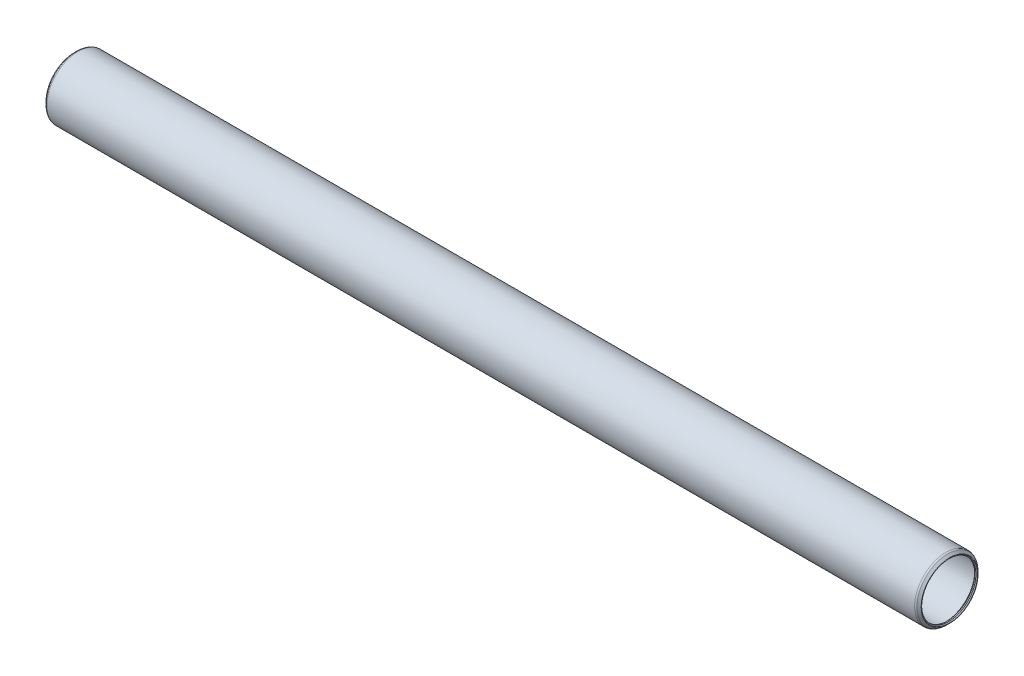
ISO-10303-21;
HEADER;
FILE_DESCRIPTION(('STEP AP214'),'2;1');
FILE_NAME('part.step','',(''),(''),'','','');
FILE_SCHEMA(('AUTOMOTIVE_DESIGN { 1 0 10303 214 1 1 1 1 }'));
ENDSEC;
DATA;
#1=APPLICATION_CONTEXT('core data for automotive mechanical design processes');
#2=APPLICATION_PROTOCOL_DEFINITION('international standard','automotive_design',2000,#1);
#3=PRODUCT_CONTEXT('',#1,'mechanical');
#4=PRODUCT('Part','Part','',(#3));
#5=PRODUCT_RELATED_PRODUCT_CATEGORY('part','',(#4));
#6=PRODUCT_DEFINITION_FORMATION('','',#4);
#7=PRODUCT_DEFINITION_CONTEXT('part definition',#1,'design');
#8=PRODUCT_DEFINITION('design','',#6,#7);
#9=PRODUCT_DEFINITION_SHAPE('','',#8);
#10=(LENGTH_UNIT() NAMED_UNIT(*) SI_UNIT(.MILLI.,.METRE.));
#11=(NAMED_UNIT(*) PLANE_ANGLE_UNIT() SI_UNIT($,.RADIAN.));
#12=(NAMED_UNIT(*) SI_UNIT($,.STERADIAN.) SOLID_ANGLE_UNIT());
#13=UNCERTAINTY_MEASURE_WITH_UNIT(LENGTH_MEASURE(1.E-05),#10,'distance_accuracy_value','');
#14=(GEOMETRIC_REPRESENTATION_CONTEXT(3) GLOBAL_UNCERTAINTY_ASSIGNED_CONTEXT((#13)) GLOBAL_UNIT_ASSIGNED_CONTEXT((#10,
#11,#12)) REPRESENTATION_CONTEXT('',''));
#15=CARTESIAN_POINT('',(0.,0.,0.));
#16=DIRECTION('',(0.,0.,1.));
#17=DIRECTION('',(1.,0.,0.));
#18=AXIS2_PLACEMENT_3D('',#15,#16,#17);
#19=CARTESIAN_POINT('',(-0.549710244842875,0.,0.));
#20=DIRECTION('',(-1.,0.,0.));
#21=DIRECTION('',(0.,0.,1.));
#22=AXIS2_PLACEMENT_3D('',#19,#20,#21);
#23=TOROIDAL_SURFACE('',#22,9.25736536726415,0.126999999999895);
#24=CARTESIAN_POINT('',(-0.639512806053455,0.,0.));
#25=DIRECTION('',(-1.,0.,0.));
#26=DIRECTION('',(0.,0.,1.));
#27=AXIS2_PLACEMENT_3D('',#24,#25,#26);
#28=CIRCLE('',#27,9.1675628060535);
#29=CARTESIAN_POINT('',(-0.639512806053455,0.,9.1675628060535));
#30=VERTEX_POINT('',#29);
#31=EDGE_CURVE('E10',#30,#30,#28,.T.);
#32=ORIENTED_EDGE('',*,*,#31,.F.);
#33=EDGE_LOOP('',(#32));
#34=FACE_BOUND('',#33,.T.);
#35=CARTESIAN_POINT('',(-0.639512806053455,0.,0.));
#36=DIRECTION('',(-1.,0.,0.));
#37=DIRECTION('',(0.,0.,1.));
#38=AXIS2_PLACEMENT_3D('',#35,#36,#37);
#39=CIRCLE('',#38,9.3471679284748);
#40=CARTESIAN_POINT('',(-0.639512806053455,0.,9.3471679284748));
#41=VERTEX_POINT('',#40);
#42=EDGE_CURVE('E76',#41,#41,#39,.T.);
#43=ORIENTED_EDGE('',*,*,#42,.T.);
#44=EDGE_LOOP('',(#43));
#45=FACE_BOUND('',#44,.T.);
#46=ADVANCED_FACE('F30',(#34,#45),#23,.T.);
#47=CARTESIAN_POINT('',(-0.639512806053455,0.,0.));
#48=DIRECTION('',(-1.,0.,0.));
#49=DIRECTION('',(0.,0.,1.));
#50=AXIS2_PLACEMENT_3D('',#47,#48,#49);
#51=CONICAL_SURFACE('',#50,9.1675628060535,0.785398163397576);
#52=CARTESIAN_POINT('',(-0.38100000000002,0.,0.));
#53=DIRECTION('',(-1.,0.,0.));
#54=DIRECTION('',(0.,0.,1.));
#55=AXIS2_PLACEMENT_3D('',#52,#53,#54);
#56=CIRCLE('',#55,8.90905);
#57=CARTESIAN_POINT('',(-0.38100000000002,0.,8.90905));
#58=VERTEX_POINT('',#57);
#59=EDGE_CURVE('E36',#58,#58,#56,.T.);
#60=ORIENTED_EDGE('',*,*,#59,.F.);
#61=EDGE_LOOP('',(#60));
#62=FACE_BOUND('',#61,.T.);
#63=ORIENTED_EDGE('',*,*,#31,.T.);
#64=EDGE_LOOP('',(#63));
#65=FACE_BOUND('',#64,.T.);
#66=ADVANCED_FACE('F149',(#62,#65),#51,.F.);
#67=CARTESIAN_POINT('',(285.8897,0.,0.));
#68=DIRECTION('',(-1.,0.,0.));
#69=DIRECTION('',(0.,0.,1.));
#70=AXIS2_PLACEMENT_3D('',#67,#68,#69);
#71=CYLINDRICAL_SURFACE('',#70,8.90905);
#72=CARTESIAN_POINT('',(0.,0.,0.));
#73=DIRECTION('',(-1.,0.,0.));
#74=DIRECTION('',(0.,0.,1.));
#75=AXIS2_PLACEMENT_3D('',#72,#73,#74);
#76=CIRCLE('',#75,8.90905);
#77=CARTESIAN_POINT('',(0.,0.,8.90905));
#78=VERTEX_POINT('',#77);
#79=EDGE_CURVE('E40',#78,#78,#76,.T.);
#80=ORIENTED_EDGE('',*,*,#79,.F.);
#81=EDGE_LOOP('',(#80));
#82=FACE_BOUND('',#81,.T.);
#83=ORIENTED_EDGE('',*,*,#59,.T.);
#84=EDGE_LOOP('',(#83));
#85=FACE_BOUND('',#84,.T.);
#86=ADVANCED_FACE('F144',(#82,#85),#71,.F.);
#87=CARTESIAN_POINT('',(0.,0.,0.));
#88=DIRECTION('',(1.,0.,0.));
#89=DIRECTION('',(0.,0.,-1.));
#90=AXIS2_PLACEMENT_3D('',#87,#88,#89);
#91=CONICAL_SURFACE('',#90,8.90905,0.785398163397457);
#92=CARTESIAN_POINT('',(0.761999999999985,0.,0.));
#93=DIRECTION('',(-1.,0.,0.));
#94=DIRECTION('',(0.,0.,1.));
#95=AXIS2_PLACEMENT_3D('',#92,#93,#94);
#96=CIRCLE('',#95,9.67105);
#97=CARTESIAN_POINT('',(0.761999999999985,0.,9.67105));
#98=VERTEX_POINT('',#97);
#99=EDGE_CURVE('E44',#98,#98,#96,.T.);
#100=ORIENTED_EDGE('',*,*,#99,.F.);
#101=EDGE_LOOP('',(#100));
#102=FACE_BOUND('',#101,.T.);
#103=ORIENTED_EDGE('',*,*,#79,.T.);
#104=EDGE_LOOP('',(#103));
#105=FACE_BOUND('',#104,.T.);
#106=ADVANCED_FACE('F138',(#102,#105),#91,.F.);
#107=CARTESIAN_POINT('',(285.8897,0.,0.));
#108=DIRECTION('',(-1.,0.,0.));
#109=DIRECTION('',(0.,0.,1.));
#110=AXIS2_PLACEMENT_3D('',#107,#108,#109);
#111=CYLINDRICAL_SURFACE('',#110,9.67105);
#112=CARTESIAN_POINT('',(285.1277,0.,0.));
#113=DIRECTION('',(-1.,0.,0.));
#114=DIRECTION('',(0.,0.,1.));
#115=AXIS2_PLACEMENT_3D('',#112,#113,#114);
#116=CIRCLE('',#115,9.67105);
#117=CARTESIAN_POINT('',(285.1277,0.,9.67105));
#118=VERTEX_POINT('',#117);
#119=EDGE_CURVE('E49',#118,#118,#116,.T.);
#120=ORIENTED_EDGE('',*,*,#119,.F.);
#121=EDGE_LOOP('',(#120));
#122=FACE_BOUND('',#121,.T.);
#123=ORIENTED_EDGE('',*,*,#99,.T.);
#124=EDGE_LOOP('',(#123));
#125=FACE_BOUND('',#124,.T.);
#126=ADVANCED_FACE('F132',(#122,#125),#111,.F.);
#127=CARTESIAN_POINT('',(285.1277,0.,0.));
#128=DIRECTION('',(-1.,0.,0.));
#129=DIRECTION('',(0.,0.,1.));
#130=AXIS2_PLACEMENT_3D('',#127,#128,#129);
#131=CONICAL_SURFACE('',#130,9.67105,0.785398163397421);
#132=CARTESIAN_POINT('',(285.8897,0.,0.));
#133=DIRECTION('',(-1.,0.,0.));
#134=DIRECTION('',(0.,0.,1.));
#135=AXIS2_PLACEMENT_3D('',#132,#133,#134);
#136=CIRCLE('',#135,8.90905);
#137=CARTESIAN_POINT('',(285.8897,0.,8.90905));
#138=VERTEX_POINT('',#137);
#139=EDGE_CURVE('E52',#138,#138,#136,.T.);
#140=ORIENTED_EDGE('',*,*,#139,.F.);
#141=EDGE_LOOP('',(#140));
#142=FACE_BOUND('',#141,.T.);
#143=ORIENTED_EDGE('',*,*,#119,.T.);
#144=EDGE_LOOP('',(#143));
#145=FACE_BOUND('',#144,.T.);
#146=ADVANCED_FACE('F126',(#142,#145),#131,.F.);
#147=CARTESIAN_POINT('',(285.8897,0.,0.));
#148=DIRECTION('',(-1.,0.,0.));
#149=DIRECTION('',(0.,0.,1.));
#150=AXIS2_PLACEMENT_3D('',#147,#148,#149);
#151=CYLINDRICAL_SURFACE('',#150,8.90905);
#152=CARTESIAN_POINT('',(286.2707,0.,0.));
#153=DIRECTION('',(-1.,0.,0.));
#154=DIRECTION('',(0.,0.,1.));
#155=AXIS2_PLACEMENT_3D('',#152,#153,#154);
#156=CIRCLE('',#155,8.90905);
#157=CARTESIAN_POINT('',(286.2707,0.,8.90905));
#158=VERTEX_POINT('',#157);
#159=EDGE_CURVE('E55',#158,#158,#156,.T.);
#160=ORIENTED_EDGE('',*,*,#159,.F.);
#161=EDGE_LOOP('',(#160));
#162=FACE_BOUND('',#161,.T.);
#163=ORIENTED_EDGE('',*,*,#139,.T.);
#164=EDGE_LOOP('',(#163));
#165=FACE_BOUND('',#164,.T.);
#166=ADVANCED_FACE('F120',(#162,#165),#151,.F.);
#167=CARTESIAN_POINT('',(286.2707,0.,0.));
#168=DIRECTION('',(1.,0.,0.));
#169=DIRECTION('',(0.,0.,-1.));
#170=AXIS2_PLACEMENT_3D('',#167,#168,#169);
#171=CONICAL_SURFACE('',#170,8.90905,0.785398163404897);
#172=CARTESIAN_POINT('',(286.52921280605,0.,0.));
#173=DIRECTION('',(-1.,0.,0.));
#174=DIRECTION('',(0.,0.,1.));
#175=AXIS2_PLACEMENT_3D('',#172,#173,#174);
#176=CIRCLE('',#175,9.16756280605368);
#177=CARTESIAN_POINT('',(286.52921280605,0.,9.16756280605368));
#178=VERTEX_POINT('',#177);
#179=EDGE_CURVE('E58',#178,#178,#176,.T.);
#180=ORIENTED_EDGE('',*,*,#179,.F.);
#181=EDGE_LOOP('',(#180));
#182=FACE_BOUND('',#181,.T.);
#183=ORIENTED_EDGE('',*,*,#159,.T.);
#184=EDGE_LOOP('',(#183));
#185=FACE_BOUND('',#184,.T.);
#186=ADVANCED_FACE('F114',(#182,#185),#171,.F.);
#187=CARTESIAN_POINT('',(286.439410244842,0.,0.));
#188=DIRECTION('',(-1.,0.,0.));
#189=DIRECTION('',(0.,0.,1.));
#190=AXIS2_PLACEMENT_3D('',#187,#188,#189);
#191=TOROIDAL_SURFACE('',#190,9.25736536726415,0.126999999998016);
#192=CARTESIAN_POINT('',(286.529212806053,0.,0.));
#193=DIRECTION('',(-1.,0.,0.));
#194=DIRECTION('',(0.,0.,1.));
#195=AXIS2_PLACEMENT_3D('',#192,#193,#194);
#196=CIRCLE('',#195,9.3471679284715);
#197=CARTESIAN_POINT('',(286.529212806053,0.,9.3471679284715));
#198=VERTEX_POINT('',#197);
#199=EDGE_CURVE('E61',#198,#198,#196,.T.);
#200=ORIENTED_EDGE('',*,*,#199,.F.);
#201=EDGE_LOOP('',(#200));
#202=FACE_BOUND('',#201,.T.);
#203=ORIENTED_EDGE('',*,*,#179,.T.);
#204=EDGE_LOOP('',(#203));
#205=FACE_BOUND('',#204,.T.);
#206=ADVANCED_FACE('F108',(#202,#205),#191,.T.);
#207=CARTESIAN_POINT('',(286.529212806053,0.,0.));
#208=DIRECTION('',(-1.,0.,0.));
#209=DIRECTION('',(0.,0.,1.));
#210=AXIS2_PLACEMENT_3D('',#207,#208,#209);
#211=CONICAL_SURFACE('',#210,9.3471679284715,0.785398163397376);
#212=CARTESIAN_POINT('',(285.844315367256,0.,0.));
#213=DIRECTION('',(-1.,0.,0.));
#214=DIRECTION('',(0.,0.,1.));
#215=AXIS2_PLACEMENT_3D('',#212,#213,#214);
#216=CIRCLE('',#215,10.0320653672684);
#217=CARTESIAN_POINT('',(285.844315367256,0.,10.0320653672684));
#218=VERTEX_POINT('',#217);
#219=EDGE_CURVE('E64',#218,#218,#216,.T.);
#220=ORIENTED_EDGE('',*,*,#219,.F.);
#221=EDGE_LOOP('',(#220));
#222=FACE_BOUND('',#221,.T.);
#223=ORIENTED_EDGE('',*,*,#199,.T.);
#224=EDGE_LOOP('',(#223));
#225=FACE_BOUND('',#224,.T.);
#226=ADVANCED_FACE('F102',(#222,#225),#211,.T.);
#227=CARTESIAN_POINT('',(285.305500000002,0.,0.));
#228=DIRECTION('',(-1.,0.,0.));
#229=DIRECTION('',(0.,0.,1.));
#230=AXIS2_PLACEMENT_3D('',#227,#228,#229);
#231=TOROIDAL_SURFACE('',#230,9.49325000001438,0.761999999985646);
#232=CARTESIAN_POINT('',(285.3055,0.,0.));
#233=DIRECTION('',(-1.,0.,0.));
#234=DIRECTION('',(0.,0.,1.));
#235=AXIS2_PLACEMENT_3D('',#232,#233,#234);
#236=CIRCLE('',#235,10.25525);
#237=CARTESIAN_POINT('',(285.3055,0.,10.25525));
#238=VERTEX_POINT('',#237);
#239=EDGE_CURVE('E67',#238,#238,#236,.T.);
#240=ORIENTED_EDGE('',*,*,#239,.F.);
#241=EDGE_LOOP('',(#240));
#242=FACE_BOUND('',#241,.T.);
#243=ORIENTED_EDGE('',*,*,#219,.T.);
#244=EDGE_LOOP('',(#243));
#245=FACE_BOUND('',#244,.T.);
#246=ADVANCED_FACE('F96',(#242,#245),#231,.T.);
#247=CARTESIAN_POINT('',(285.8897,0.,0.));
#248=DIRECTION('',(-1.,0.,0.));
#249=DIRECTION('',(0.,0.,1.));
#250=AXIS2_PLACEMENT_3D('',#247,#248,#249);
#251=CYLINDRICAL_SURFACE('',#250,10.25525);
#252=CARTESIAN_POINT('',(0.584199999999979,0.,0.));
#253=DIRECTION('',(-1.,0.,0.));
#254=DIRECTION('',(0.,0.,1.));
#255=AXIS2_PLACEMENT_3D('',#252,#253,#254);
#256=CIRCLE('',#255,10.25525);
#257=CARTESIAN_POINT('',(0.584199999999979,0.,10.25525));
#258=VERTEX_POINT('',#257);
#259=EDGE_CURVE('E70',#258,#258,#256,.T.);
#260=ORIENTED_EDGE('',*,*,#259,.F.);
#261=EDGE_LOOP('',(#260));
#262=FACE_BOUND('',#261,.T.);
#263=ORIENTED_EDGE('',*,*,#239,.T.);
#264=EDGE_LOOP('',(#263));
#265=FACE_BOUND('',#264,.T.);
#266=ADVANCED_FACE('F90',(#262,#265),#251,.T.);
#267=CARTESIAN_POINT('',(0.584199999998007,0.,0.));
#268=DIRECTION('',(-1.,0.,0.));
#269=DIRECTION('',(0.,0.,1.));
#270=AXIS2_PLACEMENT_3D('',#267,#268,#269);
#271=TOROIDAL_SURFACE('',#270,9.49325000000517,0.761999999994826);
#272=CARTESIAN_POINT('',(0.0453846327358454,0.,0.));
#273=DIRECTION('',(-1.,0.,0.));
#274=DIRECTION('',(0.,0.,1.));
#275=AXIS2_PLACEMENT_3D('',#272,#273,#274);
#276=CIRCLE('',#275,10.032065367264);
#277=CARTESIAN_POINT('',(0.0453846327358454,0.,10.032065367264));
#278=VERTEX_POINT('',#277);
#279=EDGE_CURVE('E73',#278,#278,#276,.T.);
#280=ORIENTED_EDGE('',*,*,#279,.F.);
#281=EDGE_LOOP('',(#280));
#282=FACE_BOUND('',#281,.T.);
#283=ORIENTED_EDGE('',*,*,#259,.T.);
#284=EDGE_LOOP('',(#283));
#285=FACE_BOUND('',#284,.T.);
#286=ADVANCED_FACE('F84',(#282,#285),#271,.T.);
#287=CARTESIAN_POINT('',(0.0453846327358454,0.,0.));
#288=DIRECTION('',(1.,0.,0.));
#289=DIRECTION('',(0.,0.,-1.));
#290=AXIS2_PLACEMENT_3D('',#287,#288,#289);
#291=CONICAL_SURFACE('',#290,10.032065367264,0.785398163397375);
#292=ORIENTED_EDGE('',*,*,#42,.F.);
#293=EDGE_LOOP('',(#292));
#294=FACE_BOUND('',#293,.T.);
#295=ORIENTED_EDGE('',*,*,#279,.T.);
#296=EDGE_LOOP('',(#295));
#297=FACE_BOUND('',#296,.T.);
#298=ADVANCED_FACE('F81',(#294,#297),#291,.T.);
#299=CLOSED_SHELL('',(#46,#66,#86,#106,#126,#146,#166,#186,#206,#226,#246,#266,#286,#298));
#300=MANIFOLD_SOLID_BREP('B2',#299);
#301=ADVANCED_BREP_SHAPE_REPRESENTATION('',(#18,#300),#14);
#302=SHAPE_DEFINITION_REPRESENTATION(#9,#301);
ENDSEC;
END-ISO-10303-21;
